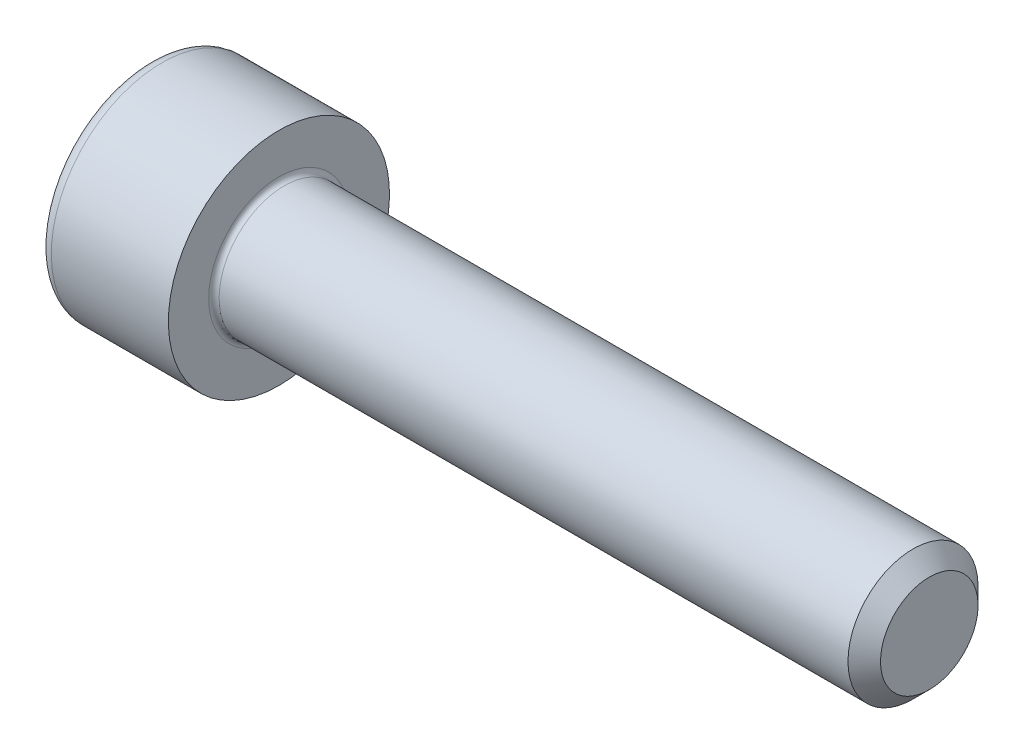
ISO-10303-21;
HEADER;
FILE_DESCRIPTION(('STEP AP214'),'2;1');
FILE_NAME('part.step','',(''),(''),'','','');
FILE_SCHEMA(('AUTOMOTIVE_DESIGN { 1 0 10303 214 1 1 1 1 }'));
ENDSEC;
DATA;
#1=APPLICATION_CONTEXT('core data for automotive mechanical design processes');
#2=APPLICATION_PROTOCOL_DEFINITION('international standard','automotive_design',2000,#1);
#3=PRODUCT_CONTEXT('',#1,'mechanical');
#4=PRODUCT('Part','Part','',(#3));
#5=PRODUCT_RELATED_PRODUCT_CATEGORY('part','',(#4));
#6=PRODUCT_DEFINITION_FORMATION('','',#4);
#7=PRODUCT_DEFINITION_CONTEXT('part definition',#1,'design');
#8=PRODUCT_DEFINITION('design','',#6,#7);
#9=PRODUCT_DEFINITION_SHAPE('','',#8);
#10=(LENGTH_UNIT() NAMED_UNIT(*) SI_UNIT(.MILLI.,.METRE.));
#11=(NAMED_UNIT(*) PLANE_ANGLE_UNIT() SI_UNIT($,.RADIAN.));
#12=(NAMED_UNIT(*) SI_UNIT($,.STERADIAN.) SOLID_ANGLE_UNIT());
#13=UNCERTAINTY_MEASURE_WITH_UNIT(LENGTH_MEASURE(1.E-05),#10,'distance_accuracy_value','');
#14=(GEOMETRIC_REPRESENTATION_CONTEXT(3) GLOBAL_UNCERTAINTY_ASSIGNED_CONTEXT((#13)) GLOBAL_UNIT_ASSIGNED_CONTEXT((#10,
#11,#12)) REPRESENTATION_CONTEXT('',''));
#15=CARTESIAN_POINT('',(0.,0.,0.));
#16=DIRECTION('',(0.,0.,1.));
#17=DIRECTION('',(1.,0.,0.));
#18=AXIS2_PLACEMENT_3D('',#15,#16,#17);
#19=CARTESIAN_POINT('',(-1.99999999995271,0.,0.));
#20=DIRECTION('',(-1.,0.,0.));
#21=DIRECTION('',(0.,0.,1.));
#22=AXIS2_PLACEMENT_3D('',#19,#20,#21);
#23=CONICAL_SURFACE('',#22,1.83319999985088,1.04719755109013);
#24=CARTESIAN_POINT('',(-0.941601486488253,-1.13686837721616E-10,0.));
#25=VERTEX_POINT('',#24);
#26=VERTEX_LOOP('',#25);
#27=FACE_BOUND('',#26,.T.);
#28=CARTESIAN_POINT('',(-2.00000000001834,0.,0.));
#29=DIRECTION('',(-1.,0.,0.));
#30=DIRECTION('',(0.,0.,1.));
#31=AXIS2_PLACEMENT_3D('',#28,#29,#30);
#32=CIRCLE('',#31,1.83319999996456);
#33=CARTESIAN_POINT('',(-2.00000000001834,-0.916599999982282,-1.58759777018694));
#34=VERTEX_POINT('',#33);
#35=CARTESIAN_POINT('',(-2.00000000001834,-1.83319999996456,0.));
#36=VERTEX_POINT('',#35);
#37=EDGE_CURVE('E89',#34,#36,#32,.T.);
#38=ORIENTED_EDGE('',*,*,#37,.T.);
#39=CARTESIAN_POINT('',(-2.00000000001834,0.,0.));
#40=DIRECTION('',(-1.,0.,0.));
#41=DIRECTION('',(0.,0.,1.));
#42=AXIS2_PLACEMENT_3D('',#39,#40,#41);
#43=CIRCLE('',#42,1.83319999996456);
#44=CARTESIAN_POINT('',(-2.00000000001834,-0.916599999982281,1.58759777018694));
#45=VERTEX_POINT('',#44);
#46=EDGE_CURVE('E84',#36,#45,#43,.T.);
#47=ORIENTED_EDGE('',*,*,#46,.T.);
#48=CARTESIAN_POINT('',(-2.00000000001834,0.,0.));
#49=DIRECTION('',(-1.,0.,0.));
#50=DIRECTION('',(0.,0.,1.));
#51=AXIS2_PLACEMENT_3D('',#48,#49,#50);
#52=CIRCLE('',#51,1.83319999996456);
#53=CARTESIAN_POINT('',(-1.99999999995271,0.916599999925436,1.58759777008849));
#54=VERTEX_POINT('',#53);
#55=EDGE_CURVE('E86',#45,#54,#52,.T.);
#56=ORIENTED_EDGE('',*,*,#55,.T.);
#57=CARTESIAN_POINT('',(-1.99999999995271,0.,0.));
#58=DIRECTION('',(-1.,0.,0.));
#59=DIRECTION('',(0.,0.,1.));
#60=AXIS2_PLACEMENT_3D('',#57,#58,#59);
#61=CIRCLE('',#60,1.83319999985088);
#62=CARTESIAN_POINT('',(-1.99999999995271,1.83319999985088,0.));
#63=VERTEX_POINT('',#62);
#64=EDGE_CURVE('E100',#54,#63,#61,.T.);
#65=ORIENTED_EDGE('',*,*,#64,.T.);
#66=CARTESIAN_POINT('',(-2.00000000001834,0.,0.));
#67=DIRECTION('',(-1.,0.,0.));
#68=DIRECTION('',(0.,0.,1.));
#69=AXIS2_PLACEMENT_3D('',#66,#67,#68);
#70=CIRCLE('',#69,1.83319999996456);
#71=CARTESIAN_POINT('',(-2.00000000001834,0.91659999998228,-1.58759777018694));
#72=VERTEX_POINT('',#71);
#73=EDGE_CURVE('E187',#63,#72,#70,.T.);
#74=ORIENTED_EDGE('',*,*,#73,.T.);
#75=CARTESIAN_POINT('',(-2.00000000001834,0.,0.));
#76=DIRECTION('',(-1.,0.,0.));
#77=DIRECTION('',(0.,0.,1.));
#78=AXIS2_PLACEMENT_3D('',#75,#76,#77);
#79=CIRCLE('',#78,1.83319999996456);
#80=EDGE_CURVE('E185',#72,#34,#79,.T.);
#81=ORIENTED_EDGE('',*,*,#80,.T.);
#82=EDGE_LOOP('',(#38,#47,#56,#65,#74,#81));
#83=FACE_BOUND('',#82,.T.);
#84=ADVANCED_FACE('F17',(#27,#83),#23,.F.);
#85=CARTESIAN_POINT('',(-2.,0.,0.));
#86=DIRECTION('',(-1.,0.,0.));
#87=DIRECTION('',(0.,-1.,0.));
#88=AXIS2_PLACEMENT_3D('',#85,#86,#87);
#89=PLANE('',#88);
#90=ORIENTED_EDGE('',*,*,#55,.F.);
#91=DIRECTION('',(0.,-1.,0.));
#92=VECTOR('',#91,1.);
#93=CARTESIAN_POINT('',(-2.,-0.9166,1.58759777021763));
#94=LINE('',#93,#92);
#95=EDGE_CURVE('E94',#45,#54,#94,.F.);
#96=ORIENTED_EDGE('',*,*,#95,.T.);
#97=EDGE_LOOP('',(#90,#96));
#98=FACE_BOUND('',#97,.T.);
#99=ADVANCED_FACE('F97',(#98),#89,.F.);
#100=CARTESIAN_POINT('',(-2.,0.,0.));
#101=DIRECTION('',(-1.,0.,0.));
#102=DIRECTION('',(0.,-1.,0.));
#103=AXIS2_PLACEMENT_3D('',#100,#101,#102);
#104=PLANE('',#103);
#105=ORIENTED_EDGE('',*,*,#64,.F.);
#106=DIRECTION('',(0.,-0.5,0.866025403784439));
#107=VECTOR('',#106,1.);
#108=CARTESIAN_POINT('',(-2.,0.9166,1.58759777021763));
#109=LINE('',#108,#107);
#110=EDGE_CURVE('E163',#54,#63,#109,.F.);
#111=ORIENTED_EDGE('',*,*,#110,.T.);
#112=EDGE_LOOP('',(#105,#111));
#113=FACE_BOUND('',#112,.T.);
#114=ADVANCED_FACE('F294',(#113),#104,.F.);
#115=CARTESIAN_POINT('',(-2.,0.,0.));
#116=DIRECTION('',(-1.,0.,0.));
#117=DIRECTION('',(0.,-1.,0.));
#118=AXIS2_PLACEMENT_3D('',#115,#116,#117);
#119=PLANE('',#118);
#120=ORIENTED_EDGE('',*,*,#73,.F.);
#121=DIRECTION('',(0.,0.5,0.866025403784439));
#122=VECTOR('',#121,1.);
#123=CARTESIAN_POINT('',(-2.,1.8332,0.));
#124=LINE('',#123,#122);
#125=EDGE_CURVE('E152',#63,#72,#124,.F.);
#126=ORIENTED_EDGE('',*,*,#125,.T.);
#127=EDGE_LOOP('',(#120,#126));
#128=FACE_BOUND('',#127,.T.);
#129=ADVANCED_FACE('F298',(#128),#119,.F.);
#130=CARTESIAN_POINT('',(-2.,0.,0.));
#131=DIRECTION('',(-1.,0.,0.));
#132=DIRECTION('',(0.,-1.,0.));
#133=AXIS2_PLACEMENT_3D('',#130,#131,#132);
#134=PLANE('',#133);
#135=ORIENTED_EDGE('',*,*,#80,.F.);
#136=DIRECTION('',(0.,1.,0.));
#137=VECTOR('',#136,1.);
#138=CARTESIAN_POINT('',(-2.,0.9166,-1.58759777021763));
#139=LINE('',#138,#137);
#140=EDGE_CURVE('E140',#72,#34,#139,.F.);
#141=ORIENTED_EDGE('',*,*,#140,.T.);
#142=EDGE_LOOP('',(#135,#141));
#143=FACE_BOUND('',#142,.T.);
#144=ADVANCED_FACE('F305',(#143),#134,.F.);
#145=CARTESIAN_POINT('',(-2.,0.,0.));
#146=DIRECTION('',(-1.,0.,0.));
#147=DIRECTION('',(0.,-1.,0.));
#148=AXIS2_PLACEMENT_3D('',#145,#146,#147);
#149=PLANE('',#148);
#150=ORIENTED_EDGE('',*,*,#37,.F.);
#151=DIRECTION('',(0.,0.5,-0.866025403784438));
#152=VECTOR('',#151,1.);
#153=CARTESIAN_POINT('',(-2.,-0.9166,-1.58759777021763));
#154=LINE('',#153,#152);
#155=EDGE_CURVE('E126',#34,#36,#154,.F.);
#156=ORIENTED_EDGE('',*,*,#155,.T.);
#157=EDGE_LOOP('',(#150,#156));
#158=FACE_BOUND('',#157,.T.);
#159=ADVANCED_FACE('F308',(#158),#149,.F.);
#160=CARTESIAN_POINT('',(-2.,0.,0.));
#161=DIRECTION('',(-1.,0.,0.));
#162=DIRECTION('',(0.,-1.,0.));
#163=AXIS2_PLACEMENT_3D('',#160,#161,#162);
#164=PLANE('',#163);
#165=ORIENTED_EDGE('',*,*,#46,.F.);
#166=DIRECTION('',(0.,-0.5,-0.866025403784438));
#167=VECTOR('',#166,1.);
#168=CARTESIAN_POINT('',(-2.,-1.8332,0.));
#169=LINE('',#168,#167);
#170=EDGE_CURVE('E102',#36,#45,#169,.F.);
#171=ORIENTED_EDGE('',*,*,#170,.T.);
#172=EDGE_LOOP('',(#165,#171));
#173=FACE_BOUND('',#172,.T.);
#174=ADVANCED_FACE('F103',(#173),#164,.F.);
#175=CARTESIAN_POINT('',(-2.,-0.9166,1.58759777021763));
#176=DIRECTION('',(0.,0.,1.));
#177=DIRECTION('',(0.,-1.,0.));
#178=AXIS2_PLACEMENT_3D('',#175,#176,#177);
#179=PLANE('',#178);
#180=DIRECTION('',(1.,0.,0.));
#181=VECTOR('',#180,1.);
#182=CARTESIAN_POINT('',(-2.,0.9166,1.58759777021763));
#183=LINE('',#182,#181);
#184=CARTESIAN_POINT('',(-4.,0.916599999999999,1.58759777021763));
#185=VERTEX_POINT('',#184);
#186=EDGE_CURVE('E114',#185,#54,#183,.T.);
#187=ORIENTED_EDGE('',*,*,#186,.T.);
#188=ORIENTED_EDGE('',*,*,#95,.F.);
#189=DIRECTION('',(1.,0.,0.));
#190=VECTOR('',#189,1.);
#191=CARTESIAN_POINT('',(-2.,-0.9166,1.58759777021763));
#192=LINE('',#191,#190);
#193=CARTESIAN_POINT('',(-4.,-0.9166,1.58759777021763));
#194=VERTEX_POINT('',#193);
#195=EDGE_CURVE('E107',#45,#194,#192,.F.);
#196=ORIENTED_EDGE('',*,*,#195,.T.);
#197=DIRECTION('',(0.,1.,0.));
#198=VECTOR('',#197,1.);
#199=CARTESIAN_POINT('',(-4.,1.8332,1.58759777021763));
#200=LINE('',#199,#198);
#201=EDGE_CURVE('E121',#194,#185,#200,.T.);
#202=ORIENTED_EDGE('',*,*,#201,.T.);
#203=EDGE_LOOP('',(#187,#188,#196,#202));
#204=FACE_BOUND('',#203,.T.);
#205=ADVANCED_FACE('F111',(#204),#179,.F.);
#206=CARTESIAN_POINT('',(-2.,0.9166,1.58759777021763));
#207=DIRECTION('',(0.,0.866025403784439,0.5));
#208=DIRECTION('',(0.,-0.5,0.866025403784439));
#209=AXIS2_PLACEMENT_3D('',#206,#207,#208);
#210=PLANE('',#209);
#211=DIRECTION('',(1.,0.,0.));
#212=VECTOR('',#211,1.);
#213=CARTESIAN_POINT('',(-2.,1.8332,0.));
#214=LINE('',#213,#212);
#215=CARTESIAN_POINT('',(-4.,1.8332,0.));
#216=VERTEX_POINT('',#215);
#217=EDGE_CURVE('E157',#216,#63,#214,.T.);
#218=ORIENTED_EDGE('',*,*,#217,.T.);
#219=ORIENTED_EDGE('',*,*,#110,.F.);
#220=ORIENTED_EDGE('',*,*,#186,.F.);
#221=DIRECTION('',(0.,0.500000000000001,-0.866025403784438));
#222=VECTOR('',#221,1.);
#223=CARTESIAN_POINT('',(-4.,0.9166,1.58759777021763));
#224=LINE('',#223,#222);
#225=EDGE_CURVE('E123',#185,#216,#224,.T.);
#226=ORIENTED_EDGE('',*,*,#225,.T.);
#227=EDGE_LOOP('',(#218,#219,#220,#226));
#228=FACE_BOUND('',#227,.T.);
#229=ADVANCED_FACE('F290',(#228),#210,.F.);
#230=CARTESIAN_POINT('',(-2.,1.8332,0.));
#231=DIRECTION('',(0.,0.866025403784439,-0.5));
#232=DIRECTION('',(0.,0.5,0.866025403784439));
#233=AXIS2_PLACEMENT_3D('',#230,#231,#232);
#234=PLANE('',#233);
#235=DIRECTION('',(1.,0.,0.));
#236=VECTOR('',#235,1.);
#237=CARTESIAN_POINT('',(-2.,0.9166,-1.58759777021763));
#238=LINE('',#237,#236);
#239=CARTESIAN_POINT('',(-4.,0.9166,-1.58759777021763));
#240=VERTEX_POINT('',#239);
#241=EDGE_CURVE('E145',#240,#72,#238,.T.);
#242=ORIENTED_EDGE('',*,*,#241,.T.);
#243=ORIENTED_EDGE('',*,*,#125,.F.);
#244=ORIENTED_EDGE('',*,*,#217,.F.);
#245=DIRECTION('',(0.,-0.499999999999999,-0.866025403784439));
#246=VECTOR('',#245,1.);
#247=CARTESIAN_POINT('',(-4.,1.8332,0.));
#248=LINE('',#247,#246);
#249=EDGE_CURVE('E147',#216,#240,#248,.T.);
#250=ORIENTED_EDGE('',*,*,#249,.T.);
#251=EDGE_LOOP('',(#242,#243,#244,#250));
#252=FACE_BOUND('',#251,.T.);
#253=ADVANCED_FACE('F301',(#252),#234,.F.);
#254=CARTESIAN_POINT('',(-2.,0.9166,-1.58759777021763));
#255=DIRECTION('',(0.,0.,-1.));
#256=DIRECTION('',(0.,1.,0.));
#257=AXIS2_PLACEMENT_3D('',#254,#255,#256);
#258=PLANE('',#257);
#259=DIRECTION('',(1.,0.,0.));
#260=VECTOR('',#259,1.);
#261=CARTESIAN_POINT('',(-2.,-0.9166,-1.58759777021763));
#262=LINE('',#261,#260);
#263=CARTESIAN_POINT('',(-4.,-0.9166,-1.58759777021763));
#264=VERTEX_POINT('',#263);
#265=EDGE_CURVE('E128',#264,#34,#262,.T.);
#266=ORIENTED_EDGE('',*,*,#265,.T.);
#267=ORIENTED_EDGE('',*,*,#140,.F.);
#268=ORIENTED_EDGE('',*,*,#241,.F.);
#269=DIRECTION('',(0.,1.,0.));
#270=VECTOR('',#269,1.);
#271=CARTESIAN_POINT('',(-4.,1.8332,-1.58759777021763));
#272=LINE('',#271,#270);
#273=EDGE_CURVE('E131',#240,#264,#272,.F.);
#274=ORIENTED_EDGE('',*,*,#273,.T.);
#275=EDGE_LOOP('',(#266,#267,#268,#274));
#276=FACE_BOUND('',#275,.T.);
#277=ADVANCED_FACE('F306',(#276),#258,.F.);
#278=CARTESIAN_POINT('',(-2.,-0.9166,-1.58759777021763));
#279=DIRECTION('',(0.,-0.866025403784438,-0.5));
#280=DIRECTION('',(0.,0.5,-0.866025403784438));
#281=AXIS2_PLACEMENT_3D('',#278,#279,#280);
#282=PLANE('',#281);
#283=DIRECTION('',(1.,0.,0.));
#284=VECTOR('',#283,1.);
#285=CARTESIAN_POINT('',(-2.,-1.8332,0.));
#286=LINE('',#285,#284);
#287=CARTESIAN_POINT('',(-4.,-1.8332,0.));
#288=VERTEX_POINT('',#287);
#289=EDGE_CURVE('E108',#288,#36,#286,.T.);
#290=ORIENTED_EDGE('',*,*,#289,.T.);
#291=ORIENTED_EDGE('',*,*,#155,.F.);
#292=ORIENTED_EDGE('',*,*,#265,.F.);
#293=DIRECTION('',(0.,-0.5,0.866025403784439));
#294=VECTOR('',#293,1.);
#295=CARTESIAN_POINT('',(-4.,-0.9166,-1.58759777021763));
#296=LINE('',#295,#294);
#297=EDGE_CURVE('E129',#264,#288,#296,.T.);
#298=ORIENTED_EDGE('',*,*,#297,.T.);
#299=EDGE_LOOP('',(#290,#291,#292,#298));
#300=FACE_BOUND('',#299,.T.);
#301=ADVANCED_FACE('F281',(#300),#282,.F.);
#302=CARTESIAN_POINT('',(-2.,-1.8332,0.));
#303=DIRECTION('',(0.,-0.866025403784438,0.5));
#304=DIRECTION('',(0.,-0.5,-0.866025403784438));
#305=AXIS2_PLACEMENT_3D('',#302,#303,#304);
#306=PLANE('',#305);
#307=ORIENTED_EDGE('',*,*,#195,.F.);
#308=ORIENTED_EDGE('',*,*,#170,.F.);
#309=ORIENTED_EDGE('',*,*,#289,.F.);
#310=DIRECTION('',(0.,0.5,0.866025403784439));
#311=VECTOR('',#310,1.);
#312=CARTESIAN_POINT('',(-4.,-1.8332,0.));
#313=LINE('',#312,#311);
#314=EDGE_CURVE('E119',#288,#194,#313,.T.);
#315=ORIENTED_EDGE('',*,*,#314,.T.);
#316=EDGE_LOOP('',(#307,#308,#309,#315));
#317=FACE_BOUND('',#316,.T.);
#318=ADVANCED_FACE('F117',(#317),#306,.F.);
#319=CARTESIAN_POINT('',(-4.,1.8332,0.));
#320=DIRECTION('',(1.,0.,0.));
#321=DIRECTION('',(0.,1.,0.));
#322=AXIS2_PLACEMENT_3D('',#319,#320,#321);
#323=PLANE('',#322);
#324=CARTESIAN_POINT('',(-4.,0.,0.));
#325=DIRECTION('',(1.,0.,0.));
#326=DIRECTION('',(0.,-1.,0.));
#327=AXIS2_PLACEMENT_3D('',#324,#325,#326);
#328=CIRCLE('',#327,3.);
#329=CARTESIAN_POINT('',(-4.,-3.,0.));
#330=VERTEX_POINT('',#329);
#331=CARTESIAN_POINT('',(-4.,3.,0.));
#332=VERTEX_POINT('',#331);
#333=EDGE_CURVE('E135',#330,#332,#328,.T.);
#334=ORIENTED_EDGE('',*,*,#333,.F.);
#335=CARTESIAN_POINT('',(-4.,0.,0.));
#336=DIRECTION('',(1.,0.,0.));
#337=DIRECTION('',(0.,1.,0.));
#338=AXIS2_PLACEMENT_3D('',#335,#336,#337);
#339=CIRCLE('',#338,3.);
#340=EDGE_CURVE('E250',#332,#330,#339,.T.);
#341=ORIENTED_EDGE('',*,*,#340,.F.);
#342=EDGE_LOOP('',(#334,#341));
#343=FACE_BOUND('',#342,.T.);
#344=ORIENTED_EDGE('',*,*,#297,.F.);
#345=ORIENTED_EDGE('',*,*,#273,.F.);
#346=ORIENTED_EDGE('',*,*,#249,.F.);
#347=ORIENTED_EDGE('',*,*,#225,.F.);
#348=ORIENTED_EDGE('',*,*,#201,.F.);
#349=ORIENTED_EDGE('',*,*,#314,.F.);
#350=EDGE_LOOP('',(#344,#345,#346,#347,#348,#349));
#351=FACE_BOUND('',#350,.T.);
#352=ADVANCED_FACE('F259',(#343,#351),#323,.F.);
#353=CARTESIAN_POINT('',(-3.6,0.,0.));
#354=DIRECTION('',(-1.,0.,0.));
#355=DIRECTION('',(0.,1.,0.));
#356=AXIS2_PLACEMENT_3D('',#353,#354,#355);
#357=TOROIDAL_SURFACE('',#356,3.,0.4);
#358=ORIENTED_EDGE('',*,*,#333,.T.);
#359=ORIENTED_EDGE('',*,*,#340,.T.);
#360=EDGE_LOOP('',(#358,#359));
#361=FACE_BOUND('',#360,.T.);
#362=CARTESIAN_POINT('',(-3.6,0.,0.));
#363=DIRECTION('',(-1.,0.,0.));
#364=DIRECTION('',(0.,-1.,0.));
#365=AXIS2_PLACEMENT_3D('',#362,#363,#364);
#366=CIRCLE('',#365,3.4);
#367=CARTESIAN_POINT('',(-3.6,-3.4,0.));
#368=VERTEX_POINT('',#367);
#369=EDGE_CURVE('E182',#368,#368,#366,.F.);
#370=ORIENTED_EDGE('',*,*,#369,.F.);
#371=EDGE_LOOP('',(#370));
#372=FACE_BOUND('',#371,.T.);
#373=ADVANCED_FACE('F254',(#361,#372),#357,.T.);
#374=CARTESIAN_POINT('',(-0.94160148652158,0.,0.));
#375=DIRECTION('',(-1.,0.,0.));
#376=DIRECTION('',(0.,-1.,0.));
#377=AXIS2_PLACEMENT_3D('',#374,#375,#376);
#378=CYLINDRICAL_SURFACE('',#377,3.4);
#379=ORIENTED_EDGE('',*,*,#369,.T.);
#380=EDGE_LOOP('',(#379));
#381=FACE_BOUND('',#380,.T.);
#382=CARTESIAN_POINT('',(0.,0.,0.));
#383=DIRECTION('',(-1.,0.,0.));
#384=DIRECTION('',(0.,-1.,0.));
#385=AXIS2_PLACEMENT_3D('',#382,#383,#384);
#386=CIRCLE('',#385,3.4);
#387=CARTESIAN_POINT('',(0.,-3.4,0.));
#388=VERTEX_POINT('',#387);
#389=EDGE_CURVE('E180',#388,#388,#386,.T.);
#390=ORIENTED_EDGE('',*,*,#389,.T.);
#391=EDGE_LOOP('',(#390));
#392=FACE_BOUND('',#391,.T.);
#393=ADVANCED_FACE('F258',(#381,#392),#378,.T.);
#394=CARTESIAN_POINT('',(20.,0.,0.));
#395=DIRECTION('',(1.,0.,0.));
#396=DIRECTION('',(0.,1.,0.));
#397=AXIS2_PLACEMENT_3D('',#394,#395,#396);
#398=PLANE('',#397);
#399=CARTESIAN_POINT('',(19.999999999925,0.,0.));
#400=DIRECTION('',(-1.,0.,0.));
#401=DIRECTION('',(0.,0.,1.));
#402=AXIS2_PLACEMENT_3D('',#399,#400,#401);
#403=CIRCLE('',#402,1.50000000013506);
#404=CARTESIAN_POINT('',(19.999999999925,0.,1.50000000013506));
#405=VERTEX_POINT('',#404);
#406=EDGE_CURVE('E176',#405,#405,#403,.T.);
#407=ORIENTED_EDGE('',*,*,#406,.F.);
#408=EDGE_LOOP('',(#407));
#409=FACE_BOUND('',#408,.T.);
#410=ADVANCED_FACE('F227',(#409),#398,.T.);
#411=CARTESIAN_POINT('',(0.,3.4,0.));
#412=DIRECTION('',(-1.,0.,0.));
#413=DIRECTION('',(0.,-1.,0.));
#414=AXIS2_PLACEMENT_3D('',#411,#412,#413);
#415=PLANE('',#414);
#416=CARTESIAN_POINT('',(0.,0.,0.));
#417=DIRECTION('',(1.,0.,0.));
#418=DIRECTION('',(0.,-1.,0.));
#419=AXIS2_PLACEMENT_3D('',#416,#417,#418);
#420=CIRCLE('',#419,2.16);
#421=CARTESIAN_POINT('',(0.,2.16,0.));
#422=VERTEX_POINT('',#421);
#423=CARTESIAN_POINT('',(0.,-2.16,0.));
#424=VERTEX_POINT('',#423);
#425=EDGE_CURVE('E179',#422,#424,#420,.F.);
#426=ORIENTED_EDGE('',*,*,#425,.T.);
#427=CARTESIAN_POINT('',(0.,0.,0.));
#428=DIRECTION('',(1.,0.,0.));
#429=DIRECTION('',(0.,1.,0.));
#430=AXIS2_PLACEMENT_3D('',#427,#428,#429);
#431=CIRCLE('',#430,2.16);
#432=EDGE_CURVE('E36',#424,#422,#431,.F.);
#433=ORIENTED_EDGE('',*,*,#432,.T.);
#434=EDGE_LOOP('',(#426,#433));
#435=FACE_BOUND('',#434,.T.);
#436=ORIENTED_EDGE('',*,*,#389,.F.);
#437=EDGE_LOOP('',(#436));
#438=FACE_BOUND('',#437,.T.);
#439=ADVANCED_FACE('F218',(#435,#438),#415,.F.);
#440=CARTESIAN_POINT('',(19.5000000001073,0.,0.));
#441=DIRECTION('',(-1.,0.,0.));
#442=DIRECTION('',(0.,0.,1.));
#443=AXIS2_PLACEMENT_3D('',#440,#441,#442);
#444=CONICAL_SURFACE('',#443,1.99999999995271,0.785398163397449);
#445=ORIENTED_EDGE('',*,*,#406,.T.);
#446=EDGE_LOOP('',(#445));
#447=FACE_BOUND('',#446,.T.);
#448=CARTESIAN_POINT('',(19.5,0.,0.));
#449=DIRECTION('',(-1.,0.,0.));
#450=DIRECTION('',(0.,-1.,0.));
#451=AXIS2_PLACEMENT_3D('',#448,#449,#450);
#452=CIRCLE('',#451,2.);
#453=CARTESIAN_POINT('',(19.5,-2.,0.));
#454=VERTEX_POINT('',#453);
#455=EDGE_CURVE('E28',#454,#454,#452,.T.);
#456=ORIENTED_EDGE('',*,*,#455,.F.);
#457=EDGE_LOOP('',(#456));
#458=FACE_BOUND('',#457,.T.);
#459=ADVANCED_FACE('F207',(#447,#458),#444,.T.);
#460=CARTESIAN_POINT('',(0.16,0.,0.));
#461=DIRECTION('',(-1.,0.,0.));
#462=DIRECTION('',(0.,1.,0.));
#463=AXIS2_PLACEMENT_3D('',#460,#461,#462);
#464=TOROIDAL_SURFACE('',#463,2.16,0.16);
#465=CARTESIAN_POINT('',(0.16,0.,0.));
#466=DIRECTION('',(-1.,0.,0.));
#467=DIRECTION('',(0.,-1.,0.));
#468=AXIS2_PLACEMENT_3D('',#465,#466,#467);
#469=CIRCLE('',#468,2.);
#470=CARTESIAN_POINT('',(0.16,-2.,0.));
#471=VERTEX_POINT('',#470);
#472=EDGE_CURVE('E10',#471,#471,#469,.F.);
#473=ORIENTED_EDGE('',*,*,#472,.F.);
#474=EDGE_LOOP('',(#473));
#475=FACE_BOUND('',#474,.T.);
#476=ORIENTED_EDGE('',*,*,#425,.F.);
#477=ORIENTED_EDGE('',*,*,#432,.F.);
#478=EDGE_LOOP('',(#476,#477));
#479=FACE_BOUND('',#478,.T.);
#480=ADVANCED_FACE('F195',(#475,#479),#464,.F.);
#481=CARTESIAN_POINT('',(-0.94160148652158,0.,0.));
#482=DIRECTION('',(-1.,0.,0.));
#483=DIRECTION('',(0.,-1.,0.));
#484=AXIS2_PLACEMENT_3D('',#481,#482,#483);
#485=CYLINDRICAL_SURFACE('',#484,2.);
#486=ORIENTED_EDGE('',*,*,#472,.T.);
#487=EDGE_LOOP('',(#486));
#488=FACE_BOUND('',#487,.T.);
#489=ORIENTED_EDGE('',*,*,#455,.T.);
#490=EDGE_LOOP('',(#489));
#491=FACE_BOUND('',#490,.T.);
#492=ADVANCED_FACE('F206',(#488,#491),#485,.T.);
#493=CLOSED_SHELL('',(#84,#99,#114,#129,#144,#159,#174,#205,#229,#253,#277,#301,#318,#352,#373,
#393,#410,#439,#459,#480,#492));
#494=MANIFOLD_SOLID_BREP('B1',#493);
#495=ADVANCED_BREP_SHAPE_REPRESENTATION('',(#18,#494),#14);
#496=SHAPE_DEFINITION_REPRESENTATION(#9,#495);
ENDSEC;
END-ISO-10303-21;
